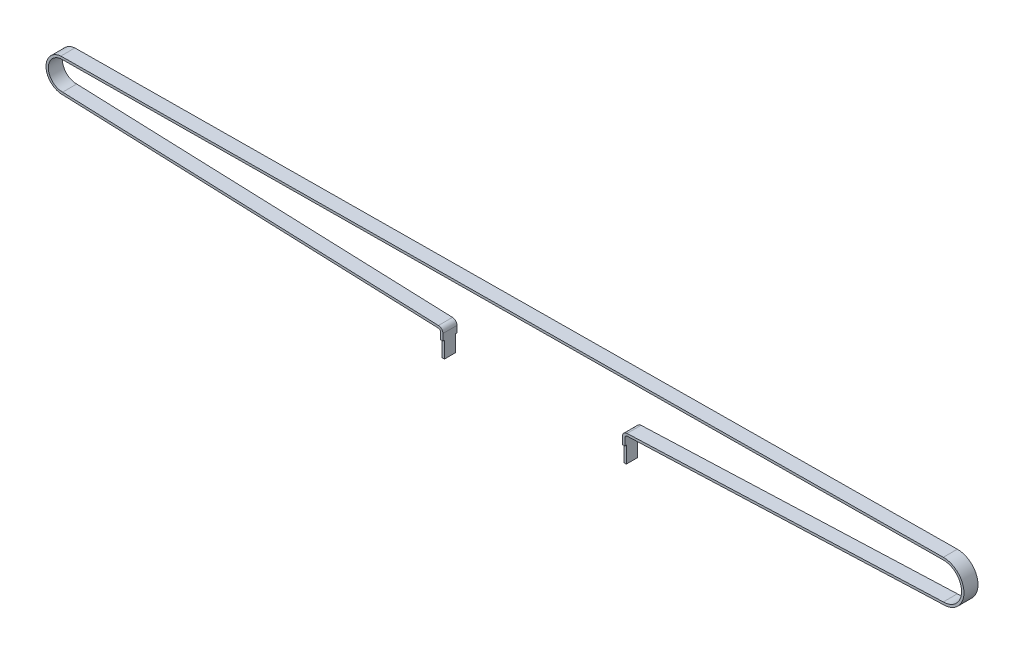
ISO-10303-21;
HEADER;
FILE_DESCRIPTION(('STEP AP214'),'2;1');
FILE_NAME('part.step','',(''),(''),'','','');
FILE_SCHEMA(('AUTOMOTIVE_DESIGN { 1 0 10303 214 1 1 1 1 }'));
ENDSEC;
DATA;
#1=APPLICATION_CONTEXT('core data for automotive mechanical design processes');
#2=APPLICATION_PROTOCOL_DEFINITION('international standard','automotive_design',2000,#1);
#3=PRODUCT_CONTEXT('',#1,'mechanical');
#4=PRODUCT('Part','Part','',(#3));
#5=PRODUCT_RELATED_PRODUCT_CATEGORY('part','',(#4));
#6=PRODUCT_DEFINITION_FORMATION('','',#4);
#7=PRODUCT_DEFINITION_CONTEXT('part definition',#1,'design');
#8=PRODUCT_DEFINITION('design','',#6,#7);
#9=PRODUCT_DEFINITION_SHAPE('','',#8);
#10=(LENGTH_UNIT() NAMED_UNIT(*) SI_UNIT(.MILLI.,.METRE.));
#11=(NAMED_UNIT(*) PLANE_ANGLE_UNIT() SI_UNIT($,.RADIAN.));
#12=(NAMED_UNIT(*) SI_UNIT($,.STERADIAN.) SOLID_ANGLE_UNIT());
#13=UNCERTAINTY_MEASURE_WITH_UNIT(LENGTH_MEASURE(1.E-05),#10,'distance_accuracy_value','');
#14=(GEOMETRIC_REPRESENTATION_CONTEXT(3) GLOBAL_UNCERTAINTY_ASSIGNED_CONTEXT((#13)) GLOBAL_UNIT_ASSIGNED_CONTEXT((#10,
#11,#12)) REPRESENTATION_CONTEXT('',''));
#15=CARTESIAN_POINT('',(0.,0.,0.));
#16=DIRECTION('',(0.,0.,1.));
#17=DIRECTION('',(1.,0.,0.));
#18=AXIS2_PLACEMENT_3D('',#15,#16,#17);
#19=CARTESIAN_POINT('',(-136.512046169934,-17.8499999999999,3.));
#20=DIRECTION('',(0.,-1.,0.));
#21=DIRECTION('',(0.,0.,-1.));
#22=AXIS2_PLACEMENT_3D('',#19,#20,#21);
#23=CYLINDRICAL_SURFACE('',#22,2.37102628897258);
#24=CARTESIAN_POINT('',(-136.512046169934,-24.8499999999999,3.));
#25=DIRECTION('',(0.,-1.,0.));
#26=DIRECTION('',(0.,0.,-1.));
#27=AXIS2_PLACEMENT_3D('',#24,#25,#26);
#28=CIRCLE('',#27,2.37102628897258);
#29=CARTESIAN_POINT('',(-136.965713461682,-24.8499999999999,0.672780274362313));
#30=VERTEX_POINT('',#29);
#31=CARTESIAN_POINT('',(-135.965713461682,-24.8499999999999,0.692775209284312));
#32=VERTEX_POINT('',#31);
#33=EDGE_CURVE('E19',#30,#32,#28,.T.);
#34=ORIENTED_EDGE('',*,*,#33,.F.);
#35=DIRECTION('',(0.,1.,0.));
#36=VECTOR('',#35,1.);
#37=CARTESIAN_POINT('',(-136.965713461682,-14.6989519799683,0.672780274362313));
#38=LINE('',#37,#36);
#39=CARTESIAN_POINT('',(-136.965713461682,-17.8499999999999,0.672780274362313));
#40=VERTEX_POINT('',#39);
#41=EDGE_CURVE('E181',#40,#30,#38,.F.);
#42=ORIENTED_EDGE('',*,*,#41,.F.);
#43=CARTESIAN_POINT('',(-136.512046169934,-17.8499999999999,3.));
#44=DIRECTION('',(0.,-1.,0.));
#45=DIRECTION('',(0.,0.,-1.));
#46=AXIS2_PLACEMENT_3D('',#43,#44,#45);
#47=CIRCLE('',#46,2.37102628897258);
#48=CARTESIAN_POINT('',(-135.965713461682,-17.8499999999999,0.692775209284312));
#49=VERTEX_POINT('',#48);
#50=EDGE_CURVE('E264',#49,#40,#47,.F.);
#51=ORIENTED_EDGE('',*,*,#50,.F.);
#52=DIRECTION('',(0.,1.,0.));
#53=VECTOR('',#52,1.);
#54=CARTESIAN_POINT('',(-135.965713461682,-14.6989519799683,0.692775209284312));
#55=LINE('',#54,#53);
#56=EDGE_CURVE('E183',#49,#32,#55,.F.);
#57=ORIENTED_EDGE('',*,*,#56,.T.);
#58=EDGE_LOOP('',(#34,#42,#51,#57));
#59=FACE_BOUND('',#58,.T.);
#60=ADVANCED_FACE('F16',(#59),#23,.T.);
#61=CARTESIAN_POINT('',(-135.965713461682,-24.8499999999998,6.));
#62=DIRECTION('',(0.,-1.,0.));
#63=DIRECTION('',(0.,0.,-1.));
#64=AXIS2_PLACEMENT_3D('',#61,#62,#63);
#65=PLANE('',#64);
#66=DIRECTION('',(0.,0.,1.));
#67=VECTOR('',#66,1.);
#68=CARTESIAN_POINT('',(-136.965713461682,-24.8499999999999,6.));
#69=LINE('',#68,#67);
#70=CARTESIAN_POINT('',(-136.965713461682,-24.8499999999999,5.32721972563769));
#71=VERTEX_POINT('',#70);
#72=EDGE_CURVE('E193',#30,#71,#69,.T.);
#73=ORIENTED_EDGE('',*,*,#72,.F.);
#74=ORIENTED_EDGE('',*,*,#33,.T.);
#75=DIRECTION('',(0.,0.,1.));
#76=VECTOR('',#75,1.);
#77=CARTESIAN_POINT('',(-135.965713461682,-24.8499999999999,6.));
#78=LINE('',#77,#76);
#79=CARTESIAN_POINT('',(-135.965713461682,-24.8499999999999,5.30722479071569));
#80=VERTEX_POINT('',#79);
#81=EDGE_CURVE('E208',#32,#80,#78,.T.);
#82=ORIENTED_EDGE('',*,*,#81,.T.);
#83=CARTESIAN_POINT('',(-136.512046169934,-24.8499999999999,3.));
#84=DIRECTION('',(0.,-1.,0.));
#85=DIRECTION('',(0.,0.,-1.));
#86=AXIS2_PLACEMENT_3D('',#83,#84,#85);
#87=CIRCLE('',#86,2.37102628897258);
#88=EDGE_CURVE('E188',#71,#80,#87,.F.);
#89=ORIENTED_EDGE('',*,*,#88,.F.);
#90=EDGE_LOOP('',(#73,#74,#82,#89));
#91=FACE_BOUND('',#90,.T.);
#92=ADVANCED_FACE('F199',(#91),#65,.T.);
#93=CARTESIAN_POINT('',(-136.512046169934,-17.8499999999999,3.));
#94=DIRECTION('',(0.,-1.,0.));
#95=DIRECTION('',(0.,0.,-1.));
#96=AXIS2_PLACEMENT_3D('',#93,#94,#95);
#97=CYLINDRICAL_SURFACE('',#96,2.37102628897258);
#98=CARTESIAN_POINT('',(-136.512046169934,-17.8499999999999,3.));
#99=DIRECTION('',(0.,-1.,0.));
#100=DIRECTION('',(0.,0.,-1.));
#101=AXIS2_PLACEMENT_3D('',#98,#99,#100);
#102=CIRCLE('',#101,2.37102628897258);
#103=CARTESIAN_POINT('',(-136.965713461682,-17.8499999999999,5.32721972563769));
#104=VERTEX_POINT('',#103);
#105=CARTESIAN_POINT('',(-135.965713461682,-17.8499999999999,5.30722479071569));
#106=VERTEX_POINT('',#105);
#107=EDGE_CURVE('E209',#104,#106,#102,.F.);
#108=ORIENTED_EDGE('',*,*,#107,.F.);
#109=DIRECTION('',(0.,1.,0.));
#110=VECTOR('',#109,1.);
#111=CARTESIAN_POINT('',(-136.965713461682,-14.6989519799683,5.32721972563769));
#112=LINE('',#111,#110);
#113=EDGE_CURVE('E201',#71,#104,#112,.T.);
#114=ORIENTED_EDGE('',*,*,#113,.F.);
#115=ORIENTED_EDGE('',*,*,#88,.T.);
#116=DIRECTION('',(0.,1.,0.));
#117=VECTOR('',#116,1.);
#118=CARTESIAN_POINT('',(-135.965713461682,-14.6989519799683,5.30722479071569));
#119=LINE('',#118,#117);
#120=EDGE_CURVE('E210',#80,#106,#119,.T.);
#121=ORIENTED_EDGE('',*,*,#120,.T.);
#122=EDGE_LOOP('',(#108,#114,#115,#121));
#123=FACE_BOUND('',#122,.T.);
#124=ADVANCED_FACE('F284',(#123),#97,.T.);
#125=CARTESIAN_POINT('',(-214.211733164608,-17.8499999999999,3.));
#126=DIRECTION('',(0.,-1.,0.));
#127=DIRECTION('',(0.,0.,-1.));
#128=AXIS2_PLACEMENT_3D('',#125,#126,#127);
#129=CYLINDRICAL_SURFACE('',#128,2.37102628897258);
#130=DIRECTION('',(0.,1.,0.));
#131=VECTOR('',#130,1.);
#132=CARTESIAN_POINT('',(-213.634920156836,-15.0663873438456,5.29979399448392));
#133=LINE('',#132,#131);
#134=CARTESIAN_POINT('',(-213.634920156836,-17.8499999999999,5.29979399448392));
#135=VERTEX_POINT('',#134);
#136=CARTESIAN_POINT('',(-213.634920156836,-24.8499999999999,5.29979399448392));
#137=VERTEX_POINT('',#136);
#138=EDGE_CURVE('E324',#135,#137,#133,.F.);
#139=ORIENTED_EDGE('',*,*,#138,.F.);
#140=CARTESIAN_POINT('',(-214.211733164608,-17.8499999999999,3.));
#141=DIRECTION('',(0.,-1.,0.));
#142=DIRECTION('',(0.,0.,-1.));
#143=AXIS2_PLACEMENT_3D('',#140,#141,#142);
#144=CIRCLE('',#143,2.37102628897258);
#145=CARTESIAN_POINT('',(-214.634920156836,-17.8499999999999,5.33295487153265));
#146=VERTEX_POINT('',#145);
#147=EDGE_CURVE('E268',#146,#135,#144,.F.);
#148=ORIENTED_EDGE('',*,*,#147,.F.);
#149=DIRECTION('',(0.,1.,0.));
#150=VECTOR('',#149,1.);
#151=CARTESIAN_POINT('',(-214.634920156836,-15.0663873438456,5.33295487153265));
#152=LINE('',#151,#150);
#153=CARTESIAN_POINT('',(-214.634920156836,-24.8499999999999,5.33295487153265));
#154=VERTEX_POINT('',#153);
#155=EDGE_CURVE('E262',#146,#154,#152,.F.);
#156=ORIENTED_EDGE('',*,*,#155,.T.);
#157=CARTESIAN_POINT('',(-214.211733164608,-24.8499999999999,3.));
#158=DIRECTION('',(0.,-1.,0.));
#159=DIRECTION('',(0.,0.,-1.));
#160=AXIS2_PLACEMENT_3D('',#157,#158,#159);
#161=CIRCLE('',#160,2.37102628897258);
#162=EDGE_CURVE('E280',#137,#154,#161,.T.);
#163=ORIENTED_EDGE('',*,*,#162,.F.);
#164=EDGE_LOOP('',(#139,#148,#156,#163));
#165=FACE_BOUND('',#164,.T.);
#166=ADVANCED_FACE('F359',(#165),#129,.T.);
#167=CARTESIAN_POINT('',(-213.634920156836,-24.8499999999999,6.));
#168=DIRECTION('',(0.,-1.,0.));
#169=DIRECTION('',(0.,0.,-1.));
#170=AXIS2_PLACEMENT_3D('',#167,#168,#169);
#171=PLANE('',#170);
#172=CARTESIAN_POINT('',(-214.211733164608,-24.8499999999999,3.));
#173=DIRECTION('',(0.,-1.,0.));
#174=DIRECTION('',(0.,0.,-1.));
#175=AXIS2_PLACEMENT_3D('',#172,#173,#174);
#176=CIRCLE('',#175,2.37102628897258);
#177=CARTESIAN_POINT('',(-213.634920156836,-24.8499999999999,0.700206005516082));
#178=VERTEX_POINT('',#177);
#179=CARTESIAN_POINT('',(-214.634920156836,-24.8499999999999,0.667045128467347));
#180=VERTEX_POINT('',#179);
#181=EDGE_CURVE('E278',#178,#180,#176,.F.);
#182=ORIENTED_EDGE('',*,*,#181,.F.);
#183=DIRECTION('',(0.,0.,-1.));
#184=VECTOR('',#183,1.);
#185=CARTESIAN_POINT('',(-213.634920156836,-24.8499999999999,6.));
#186=LINE('',#185,#184);
#187=EDGE_CURVE('E346',#137,#178,#186,.T.);
#188=ORIENTED_EDGE('',*,*,#187,.F.);
#189=ORIENTED_EDGE('',*,*,#162,.T.);
#190=DIRECTION('',(0.,0.,-1.));
#191=VECTOR('',#190,1.);
#192=CARTESIAN_POINT('',(-214.634920156836,-24.8499999999999,6.));
#193=LINE('',#192,#191);
#194=EDGE_CURVE('E335',#154,#180,#193,.T.);
#195=ORIENTED_EDGE('',*,*,#194,.T.);
#196=EDGE_LOOP('',(#182,#188,#189,#195));
#197=FACE_BOUND('',#196,.T.);
#198=ADVANCED_FACE('F362',(#197),#171,.T.);
#199=CARTESIAN_POINT('',(-214.211733164608,-17.8499999999999,3.));
#200=DIRECTION('',(0.,-1.,0.));
#201=DIRECTION('',(0.,0.,-1.));
#202=AXIS2_PLACEMENT_3D('',#199,#200,#201);
#203=CYLINDRICAL_SURFACE('',#202,2.37102628897258);
#204=ORIENTED_EDGE('',*,*,#181,.T.);
#205=DIRECTION('',(0.,1.,0.));
#206=VECTOR('',#205,1.);
#207=CARTESIAN_POINT('',(-214.634920156836,-15.0663873438456,0.667045128467348));
#208=LINE('',#207,#206);
#209=CARTESIAN_POINT('',(-214.634920156836,-17.8499999999999,0.667045128467347));
#210=VERTEX_POINT('',#209);
#211=EDGE_CURVE('E336',#180,#210,#208,.T.);
#212=ORIENTED_EDGE('',*,*,#211,.T.);
#213=CARTESIAN_POINT('',(-214.211733164608,-17.8499999999999,3.));
#214=DIRECTION('',(0.,-1.,0.));
#215=DIRECTION('',(0.,0.,-1.));
#216=AXIS2_PLACEMENT_3D('',#213,#214,#215);
#217=CIRCLE('',#216,2.37102628897258);
#218=CARTESIAN_POINT('',(-213.634920156836,-17.8499999999999,0.700206005516082));
#219=VERTEX_POINT('',#218);
#220=EDGE_CURVE('E260',#219,#210,#217,.F.);
#221=ORIENTED_EDGE('',*,*,#220,.F.);
#222=DIRECTION('',(0.,1.,0.));
#223=VECTOR('',#222,1.);
#224=CARTESIAN_POINT('',(-213.634920156836,-15.0663873438456,0.700206005516082));
#225=LINE('',#224,#223);
#226=EDGE_CURVE('E342',#178,#219,#225,.T.);
#227=ORIENTED_EDGE('',*,*,#226,.F.);
#228=EDGE_LOOP('',(#204,#212,#221,#227));
#229=FACE_BOUND('',#228,.T.);
#230=ADVANCED_FACE('F365',(#229),#203,.T.);
#231=CARTESIAN_POINT('',(-215.634920156836,-15.0663873438456,6.));
#232=DIRECTION('',(0.,0.,-1.));
#233=DIRECTION('',(-1.,0.,0.));
#234=AXIS2_PLACEMENT_3D('',#231,#232,#233);
#235=CYLINDRICAL_SURFACE('',#234,1.);
#236=DIRECTION('',(0.,0.,-1.));
#237=VECTOR('',#236,1.);
#238=CARTESIAN_POINT('',(-214.634920156836,-15.0663873438456,6.));
#239=LINE('',#238,#237);
#240=CARTESIAN_POINT('',(-214.634920156836,-15.0663873438456,0.));
#241=VERTEX_POINT('',#240);
#242=CARTESIAN_POINT('',(-214.634920156836,-15.0663873438456,6.));
#243=VERTEX_POINT('',#242);
#244=EDGE_CURVE('E312',#241,#243,#239,.F.);
#245=ORIENTED_EDGE('',*,*,#244,.T.);
#246=CARTESIAN_POINT('',(-215.634920156836,-15.0663873438456,6.));
#247=DIRECTION('',(0.,0.,-1.));
#248=DIRECTION('',(-1.,0.,0.));
#249=AXIS2_PLACEMENT_3D('',#246,#247,#248);
#250=CIRCLE('',#249,1.);
#251=CARTESIAN_POINT('',(-215.597127485655,-14.0671017420254,6.));
#252=VERTEX_POINT('',#251);
#253=EDGE_CURVE('E276',#252,#243,#250,.T.);
#254=ORIENTED_EDGE('',*,*,#253,.F.);
#255=DIRECTION('',(0.,0.,1.));
#256=VECTOR('',#255,1.);
#257=CARTESIAN_POINT('',(-215.597127485655,-14.0671017420254,6.));
#258=LINE('',#257,#256);
#259=CARTESIAN_POINT('',(-215.597127485655,-14.0671017420254,0.));
#260=VERTEX_POINT('',#259);
#261=EDGE_CURVE('E311',#252,#260,#258,.F.);
#262=ORIENTED_EDGE('',*,*,#261,.T.);
#263=CARTESIAN_POINT('',(-215.634920156836,-15.0663873438456,0.));
#264=DIRECTION('',(0.,0.,-1.));
#265=DIRECTION('',(-1.,0.,0.));
#266=AXIS2_PLACEMENT_3D('',#263,#264,#265);
#267=CIRCLE('',#266,1.);
#268=EDGE_CURVE('E274',#241,#260,#267,.F.);
#269=ORIENTED_EDGE('',*,*,#268,.F.);
#270=EDGE_LOOP('',(#245,#254,#262,#269));
#271=FACE_BOUND('',#270,.T.);
#272=ADVANCED_FACE('F523',(#271),#235,.F.);
#273=CARTESIAN_POINT('',(-134.965713461682,-14.6989519799683,6.));
#274=DIRECTION('',(0.,0.,-1.));
#275=DIRECTION('',(-1.,0.,0.));
#276=AXIS2_PLACEMENT_3D('',#273,#274,#275);
#277=CYLINDRICAL_SURFACE('',#276,1.);
#278=DIRECTION('',(0.,0.,1.));
#279=VECTOR('',#278,1.);
#280=CARTESIAN_POINT('',(-135.004194493676,-13.6996926491754,6.));
#281=LINE('',#280,#279);
#282=CARTESIAN_POINT('',(-135.004194493676,-13.6996926491754,0.));
#283=VERTEX_POINT('',#282);
#284=CARTESIAN_POINT('',(-135.004194493676,-13.6996926491754,6.));
#285=VERTEX_POINT('',#284);
#286=EDGE_CURVE('E781',#283,#285,#281,.T.);
#287=ORIENTED_EDGE('',*,*,#286,.T.);
#288=CARTESIAN_POINT('',(-134.965713461682,-14.6989519799683,6.));
#289=DIRECTION('',(0.,0.,-1.));
#290=DIRECTION('',(-1.,0.,0.));
#291=AXIS2_PLACEMENT_3D('',#288,#289,#290);
#292=CIRCLE('',#291,1.);
#293=CARTESIAN_POINT('',(-135.965713461682,-14.6989519799683,6.));
#294=VERTEX_POINT('',#293);
#295=EDGE_CURVE('E272',#294,#285,#292,.T.);
#296=ORIENTED_EDGE('',*,*,#295,.F.);
#297=DIRECTION('',(0.,0.,1.));
#298=VECTOR('',#297,1.);
#299=CARTESIAN_POINT('',(-135.965713461682,-14.6989519799683,6.));
#300=LINE('',#299,#298);
#301=CARTESIAN_POINT('',(-135.965713461682,-14.6989519799683,0.));
#302=VERTEX_POINT('',#301);
#303=EDGE_CURVE('E297',#294,#302,#300,.F.);
#304=ORIENTED_EDGE('',*,*,#303,.T.);
#305=CARTESIAN_POINT('',(-134.965713461682,-14.6989519799683,0.));
#306=DIRECTION('',(0.,0.,-1.));
#307=DIRECTION('',(-1.,0.,0.));
#308=AXIS2_PLACEMENT_3D('',#305,#306,#307);
#309=CIRCLE('',#308,1.);
#310=EDGE_CURVE('E270',#283,#302,#309,.F.);
#311=ORIENTED_EDGE('',*,*,#310,.F.);
#312=EDGE_LOOP('',(#287,#296,#304,#311));
#313=FACE_BOUND('',#312,.T.);
#314=ADVANCED_FACE('F519',(#313),#277,.F.);
#315=CARTESIAN_POINT('',(-214.211733164608,-17.8499999999999,3.));
#316=DIRECTION('',(0.,-1.,0.));
#317=DIRECTION('',(0.,0.,-1.));
#318=AXIS2_PLACEMENT_3D('',#315,#316,#317);
#319=PLANE('',#318);
#320=DIRECTION('',(0.,0.,-1.));
#321=VECTOR('',#320,1.);
#322=CARTESIAN_POINT('',(-213.634920156836,-17.8499999999999,6.));
#323=LINE('',#322,#321);
#324=CARTESIAN_POINT('',(-213.634920156836,-17.8499999999999,6.));
#325=VERTEX_POINT('',#324);
#326=EDGE_CURVE('E321',#325,#135,#323,.T.);
#327=ORIENTED_EDGE('',*,*,#326,.F.);
#328=DIRECTION('',(-1.,0.,0.));
#329=VECTOR('',#328,1.);
#330=CARTESIAN_POINT('',(-215.634920156836,-17.8499999999999,6.));
#331=LINE('',#330,#329);
#332=CARTESIAN_POINT('',(-214.634920156836,-17.8499999999999,6.));
#333=VERTEX_POINT('',#332);
#334=EDGE_CURVE('E315',#325,#333,#331,.T.);
#335=ORIENTED_EDGE('',*,*,#334,.T.);
#336=DIRECTION('',(0.,0.,-1.));
#337=VECTOR('',#336,1.);
#338=CARTESIAN_POINT('',(-214.634920156836,-17.8499999999999,6.));
#339=LINE('',#338,#337);
#340=EDGE_CURVE('E308',#333,#146,#339,.T.);
#341=ORIENTED_EDGE('',*,*,#340,.T.);
#342=ORIENTED_EDGE('',*,*,#147,.T.);
#343=EDGE_LOOP('',(#327,#335,#341,#342));
#344=FACE_BOUND('',#343,.T.);
#345=ADVANCED_FACE('F516',(#344),#319,.T.);
#346=CARTESIAN_POINT('',(-136.512046169934,-17.8499999999999,3.));
#347=DIRECTION('',(0.,-1.,0.));
#348=DIRECTION('',(0.,0.,-1.));
#349=AXIS2_PLACEMENT_3D('',#346,#347,#348);
#350=PLANE('',#349);
#351=DIRECTION('',(-1.,0.,0.));
#352=VECTOR('',#351,1.);
#353=CARTESIAN_POINT('',(-215.634920156836,-17.8499999999999,6.));
#354=LINE('',#353,#352);
#355=CARTESIAN_POINT('',(-135.965713461682,-17.8499999999999,6.));
#356=VERTEX_POINT('',#355);
#357=CARTESIAN_POINT('',(-136.965713461682,-17.8499999999999,6.));
#358=VERTEX_POINT('',#357);
#359=EDGE_CURVE('E237',#356,#358,#354,.T.);
#360=ORIENTED_EDGE('',*,*,#359,.T.);
#361=DIRECTION('',(0.,0.,1.));
#362=VECTOR('',#361,1.);
#363=CARTESIAN_POINT('',(-136.965713461682,-17.8499999999999,6.));
#364=LINE('',#363,#362);
#365=EDGE_CURVE('E203',#104,#358,#364,.T.);
#366=ORIENTED_EDGE('',*,*,#365,.F.);
#367=ORIENTED_EDGE('',*,*,#107,.T.);
#368=DIRECTION('',(0.,0.,1.));
#369=VECTOR('',#368,1.);
#370=CARTESIAN_POINT('',(-135.965713461682,-17.8499999999999,6.));
#371=LINE('',#370,#369);
#372=EDGE_CURVE('E213',#106,#356,#371,.T.);
#373=ORIENTED_EDGE('',*,*,#372,.T.);
#374=EDGE_LOOP('',(#360,#366,#367,#373));
#375=FACE_BOUND('',#374,.T.);
#376=ADVANCED_FACE('F513',(#375),#350,.T.);
#377=CARTESIAN_POINT('',(-135.965713461682,-14.6989519799683,6.));
#378=DIRECTION('',(-1.,0.,0.));
#379=DIRECTION('',(0.,0.,1.));
#380=AXIS2_PLACEMENT_3D('',#377,#378,#379);
#381=PLANE('',#380);
#382=DIRECTION('',(0.,1.,0.));
#383=VECTOR('',#382,1.);
#384=CARTESIAN_POINT('',(-135.965713461682,-15.0663873438456,0.));
#385=LINE('',#384,#383);
#386=CARTESIAN_POINT('',(-135.965713461682,-17.8499999999999,0.));
#387=VERTEX_POINT('',#386);
#388=EDGE_CURVE('E236',#302,#387,#385,.F.);
#389=ORIENTED_EDGE('',*,*,#388,.F.);
#390=ORIENTED_EDGE('',*,*,#303,.F.);
#391=DIRECTION('',(0.,1.,0.));
#392=VECTOR('',#391,1.);
#393=CARTESIAN_POINT('',(-135.965713461682,-15.0663873438456,6.));
#394=LINE('',#393,#392);
#395=EDGE_CURVE('E293',#294,#356,#394,.F.);
#396=ORIENTED_EDGE('',*,*,#395,.T.);
#397=ORIENTED_EDGE('',*,*,#372,.F.);
#398=ORIENTED_EDGE('',*,*,#120,.F.);
#399=ORIENTED_EDGE('',*,*,#81,.F.);
#400=ORIENTED_EDGE('',*,*,#56,.F.);
#401=DIRECTION('',(0.,0.,-1.));
#402=VECTOR('',#401,1.);
#403=CARTESIAN_POINT('',(-135.965713461682,-17.8499999999999,3.));
#404=LINE('',#403,#402);
#405=EDGE_CURVE('E266',#387,#49,#404,.F.);
#406=ORIENTED_EDGE('',*,*,#405,.F.);
#407=EDGE_LOOP('',(#389,#390,#396,#397,#398,#399,#400,#406));
#408=FACE_BOUND('',#407,.T.);
#409=ADVANCED_FACE('F288',(#408),#381,.F.);
#410=CARTESIAN_POINT('',(-136.512046169934,-17.8499999999999,3.));
#411=DIRECTION('',(0.,-1.,0.));
#412=DIRECTION('',(0.,0.,-1.));
#413=AXIS2_PLACEMENT_3D('',#410,#411,#412);
#414=PLANE('',#413);
#415=ORIENTED_EDGE('',*,*,#50,.T.);
#416=DIRECTION('',(0.,0.,1.));
#417=VECTOR('',#416,1.);
#418=CARTESIAN_POINT('',(-136.965713461682,-17.8499999999999,6.));
#419=LINE('',#418,#417);
#420=CARTESIAN_POINT('',(-136.965713461682,-17.8499999999999,0.));
#421=VERTEX_POINT('',#420);
#422=EDGE_CURVE('E197',#421,#40,#419,.T.);
#423=ORIENTED_EDGE('',*,*,#422,.F.);
#424=DIRECTION('',(-1.,0.,0.));
#425=VECTOR('',#424,1.);
#426=CARTESIAN_POINT('',(-215.634920156836,-17.8499999999999,0.));
#427=LINE('',#426,#425);
#428=EDGE_CURVE('E411',#387,#421,#427,.T.);
#429=ORIENTED_EDGE('',*,*,#428,.F.);
#430=ORIENTED_EDGE('',*,*,#405,.T.);
#431=EDGE_LOOP('',(#415,#423,#429,#430));
#432=FACE_BOUND('',#431,.T.);
#433=ADVANCED_FACE('F421',(#432),#414,.T.);
#434=CARTESIAN_POINT('',(-136.965713461682,-14.6989519799683,6.));
#435=DIRECTION('',(-1.,0.,0.));
#436=DIRECTION('',(0.,0.,1.));
#437=AXIS2_PLACEMENT_3D('',#434,#435,#436);
#438=PLANE('',#437);
#439=DIRECTION('',(0.,1.,0.));
#440=VECTOR('',#439,1.);
#441=CARTESIAN_POINT('',(-136.965713461682,-15.0663873438456,6.));
#442=LINE('',#441,#440);
#443=CARTESIAN_POINT('',(-136.965713461682,-14.6989519799683,6.));
#444=VERTEX_POINT('',#443);
#445=EDGE_CURVE('E259',#358,#444,#442,.T.);
#446=ORIENTED_EDGE('',*,*,#445,.T.);
#447=DIRECTION('',(0.,0.,-1.));
#448=VECTOR('',#447,1.);
#449=CARTESIAN_POINT('',(-136.965713461682,-14.6989519799683,6.));
#450=LINE('',#449,#448);
#451=CARTESIAN_POINT('',(-136.965713461682,-14.6989519799683,0.));
#452=VERTEX_POINT('',#451);
#453=EDGE_CURVE('E330',#452,#444,#450,.F.);
#454=ORIENTED_EDGE('',*,*,#453,.F.);
#455=DIRECTION('',(0.,1.,0.));
#456=VECTOR('',#455,1.);
#457=CARTESIAN_POINT('',(-136.965713461682,-15.0663873438456,0.));
#458=LINE('',#457,#456);
#459=EDGE_CURVE('E233',#421,#452,#458,.T.);
#460=ORIENTED_EDGE('',*,*,#459,.F.);
#461=ORIENTED_EDGE('',*,*,#422,.T.);
#462=ORIENTED_EDGE('',*,*,#41,.T.);
#463=ORIENTED_EDGE('',*,*,#72,.T.);
#464=ORIENTED_EDGE('',*,*,#113,.T.);
#465=ORIENTED_EDGE('',*,*,#365,.T.);
#466=EDGE_LOOP('',(#446,#454,#460,#461,#462,#463,#464,#465));
#467=FACE_BOUND('',#466,.T.);
#468=ADVANCED_FACE('F192',(#467),#438,.T.);
#469=CARTESIAN_POINT('',(-134.965713461682,-14.6989519799683,6.));
#470=DIRECTION('',(0.,0.,-1.));
#471=DIRECTION('',(-1.,0.,0.));
#472=AXIS2_PLACEMENT_3D('',#469,#470,#471);
#473=CYLINDRICAL_SURFACE('',#472,2.);
#474=CARTESIAN_POINT('',(-134.965713461682,-14.6989519799683,6.));
#475=DIRECTION('',(0.,0.,-1.));
#476=DIRECTION('',(-1.,0.,0.));
#477=AXIS2_PLACEMENT_3D('',#474,#475,#476);
#478=CIRCLE('',#477,2.);
#479=CARTESIAN_POINT('',(-135.042675525671,-12.7004333183825,6.));
#480=VERTEX_POINT('',#479);
#481=EDGE_CURVE('E256',#444,#480,#478,.T.);
#482=ORIENTED_EDGE('',*,*,#481,.T.);
#483=DIRECTION('',(0.,0.,1.));
#484=VECTOR('',#483,1.);
#485=CARTESIAN_POINT('',(-135.042675525671,-12.7004333183825,6.));
#486=LINE('',#485,#484);
#487=CARTESIAN_POINT('',(-135.042675525671,-12.7004333183825,0.));
#488=VERTEX_POINT('',#487);
#489=EDGE_CURVE('E405',#488,#480,#486,.T.);
#490=ORIENTED_EDGE('',*,*,#489,.F.);
#491=CARTESIAN_POINT('',(-134.965713461682,-14.6989519799683,0.));
#492=DIRECTION('',(0.,0.,-1.));
#493=DIRECTION('',(-1.,0.,0.));
#494=AXIS2_PLACEMENT_3D('',#491,#492,#493);
#495=CIRCLE('',#494,2.);
#496=EDGE_CURVE('E231',#452,#488,#495,.T.);
#497=ORIENTED_EDGE('',*,*,#496,.F.);
#498=ORIENTED_EDGE('',*,*,#453,.T.);
#499=EDGE_LOOP('',(#482,#490,#497,#498));
#500=FACE_BOUND('',#499,.T.);
#501=ADVANCED_FACE('F502',(#500),#473,.T.);
#502=CARTESIAN_POINT('',(2.10959385471912E-12,-7.49999999999987,6.));
#503=DIRECTION('',(-0.0384810319947494,0.999259330792872,0.));
#504=DIRECTION('',(-0.999259330792872,-0.0384810319947494,0.));
#505=AXIS2_PLACEMENT_3D('',#502,#503,#504);
#506=PLANE('',#505);
#507=DIRECTION('',(0.999259330792872,0.0384810319947494,0.));
#508=VECTOR('',#507,1.);
#509=CARTESIAN_POINT('',(-135.042675525671,-12.7004333183825,6.));
#510=LINE('',#509,#508);
#511=CARTESIAN_POINT('',(2.10358260758353E-12,-7.49999999999987,6.));
#512=VERTEX_POINT('',#511);
#513=EDGE_CURVE('E255',#480,#512,#510,.T.);
#514=ORIENTED_EDGE('',*,*,#513,.T.);
#515=DIRECTION('',(0.,0.,-1.));
#516=VECTOR('',#515,1.);
#517=CARTESIAN_POINT('',(2.11088741972065E-12,-7.49999999999987,6.));
#518=LINE('',#517,#516);
#519=CARTESIAN_POINT('',(2.10516825326079E-12,-7.49999999999987,0.));
#520=VERTEX_POINT('',#519);
#521=EDGE_CURVE('E402',#512,#520,#518,.T.);
#522=ORIENTED_EDGE('',*,*,#521,.T.);
#523=DIRECTION('',(0.999259330792872,0.0384810319947494,0.));
#524=VECTOR('',#523,1.);
#525=CARTESIAN_POINT('',(-135.042675525671,-12.7004333183825,0.));
#526=LINE('',#525,#524);
#527=EDGE_CURVE('E230',#488,#520,#526,.T.);
#528=ORIENTED_EDGE('',*,*,#527,.F.);
#529=ORIENTED_EDGE('',*,*,#489,.T.);
#530=EDGE_LOOP('',(#514,#522,#528,#529));
#531=FACE_BOUND('',#530,.T.);
#532=ADVANCED_FACE('F498',(#531),#506,.T.);
#533=CARTESIAN_POINT('',(0.0626088957112461,0.250000000000125,6.));
#534=DIRECTION('',(0.,0.,-1.));
#535=DIRECTION('',(-1.,0.,0.));
#536=AXIS2_PLACEMENT_3D('',#533,#534,#535);
#537=CYLINDRICAL_SURFACE('',#536,7.75025289095923);
#538=ORIENTED_EDGE('',*,*,#521,.F.);
#539=CARTESIAN_POINT('',(0.0626088957112461,0.250000000000125,6.));
#540=DIRECTION('',(0.,0.,-1.));
#541=DIRECTION('',(-1.,0.,0.));
#542=AXIS2_PLACEMENT_3D('',#539,#540,#541);
#543=CIRCLE('',#542,7.75025289095923);
#544=CARTESIAN_POINT('',(2.12215541204406E-12,8.00000000000012,6.));
#545=VERTEX_POINT('',#544);
#546=EDGE_CURVE('E252',#512,#545,#543,.F.);
#547=ORIENTED_EDGE('',*,*,#546,.T.);
#548=DIRECTION('',(0.,0.,1.));
#549=VECTOR('',#548,1.);
#550=CARTESIAN_POINT('',(2.10938121980497E-12,8.00000000000012,6.));
#551=LINE('',#550,#549);
#552=CARTESIAN_POINT('',(2.12215541204406E-12,8.00000000000012,0.));
#553=VERTEX_POINT('',#552);
#554=EDGE_CURVE('E400',#553,#545,#551,.T.);
#555=ORIENTED_EDGE('',*,*,#554,.F.);
#556=CARTESIAN_POINT('',(0.0626088957112461,0.250000000000125,0.));
#557=DIRECTION('',(0.,0.,-1.));
#558=DIRECTION('',(-1.,0.,0.));
#559=AXIS2_PLACEMENT_3D('',#556,#557,#558);
#560=CIRCLE('',#559,7.75025289095923);
#561=EDGE_CURVE('E228',#520,#553,#560,.F.);
#562=ORIENTED_EDGE('',*,*,#561,.F.);
#563=EDGE_LOOP('',(#538,#547,#555,#562));
#564=FACE_BOUND('',#563,.T.);
#565=ADVANCED_FACE('F494',(#564),#537,.F.);
#566=CARTESIAN_POINT('',(2.10938121980497E-12,8.00000000000012,6.));
#567=DIRECTION('',(0.00807830358441217,-0.99996736997324,0.));
#568=DIRECTION('',(0.99996736997324,0.00807830358441217,0.));
#569=AXIS2_PLACEMENT_3D('',#566,#567,#568);
#570=PLANE('',#569);
#571=DIRECTION('',(-0.99996736997324,-0.00807830358440887,0.));
#572=VECTOR('',#571,1.);
#573=CARTESIAN_POINT('',(2.1094237467878E-12,8.00000000000012,6.));
#574=LINE('',#573,#572);
#575=CARTESIAN_POINT('',(-376.720010472211,4.95664208423368,6.));
#576=VERTEX_POINT('',#575);
#577=EDGE_CURVE('E251',#545,#576,#574,.T.);
#578=ORIENTED_EDGE('',*,*,#577,.T.);
#579=DIRECTION('',(0.,0.,-1.));
#580=VECTOR('',#579,1.);
#581=CARTESIAN_POINT('',(-376.720010472211,4.95664208423369,6.));
#582=LINE('',#581,#580);
#583=CARTESIAN_POINT('',(-376.720010472211,4.95664208423368,0.));
#584=VERTEX_POINT('',#583);
#585=EDGE_CURVE('E397',#576,#584,#582,.T.);
#586=ORIENTED_EDGE('',*,*,#585,.T.);
#587=DIRECTION('',(-0.99996736997324,-0.00807830358440887,0.));
#588=VECTOR('',#587,1.);
#589=CARTESIAN_POINT('',(2.1094237467878E-12,8.00000000000012,0.));
#590=LINE('',#589,#588);
#591=EDGE_CURVE('E227',#553,#584,#590,.T.);
#592=ORIENTED_EDGE('',*,*,#591,.F.);
#593=ORIENTED_EDGE('',*,*,#554,.T.);
#594=EDGE_LOOP('',(#578,#586,#592,#593));
#595=FACE_BOUND('',#594,.T.);
#596=ADVANCED_FACE('F490',(#595),#570,.T.);
#597=CARTESIAN_POINT('',(-376.114107736079,-1.00687139119591,6.));
#598=DIRECTION('',(0.,0.,-1.));
#599=DIRECTION('',(-1.,0.,0.));
#600=AXIS2_PLACEMENT_3D('',#597,#598,#599);
#601=CYLINDRICAL_SURFACE('',#600,5.99421480239753);
#602=CARTESIAN_POINT('',(-376.114107736079,-1.00687139119591,6.));
#603=DIRECTION('',(0.,0.,-1.));
#604=DIRECTION('',(-1.,0.,0.));
#605=AXIS2_PLACEMENT_3D('',#602,#603,#604);
#606=CIRCLE('',#605,5.99421480239753);
#607=CARTESIAN_POINT('',(-376.000000000046,-7.00000000001672,6.));
#608=VERTEX_POINT('',#607);
#609=EDGE_CURVE('E248',#576,#608,#606,.F.);
#610=ORIENTED_EDGE('',*,*,#609,.T.);
#611=DIRECTION('',(0.,0.,1.));
#612=VECTOR('',#611,1.);
#613=CARTESIAN_POINT('',(-376.000000000035,-7.00000000001712,6.));
#614=LINE('',#613,#612);
#615=CARTESIAN_POINT('',(-376.000000000046,-7.00000000001672,0.));
#616=VERTEX_POINT('',#615);
#617=EDGE_CURVE('E395',#616,#608,#614,.T.);
#618=ORIENTED_EDGE('',*,*,#617,.F.);
#619=CARTESIAN_POINT('',(-376.114107736079,-1.00687139119591,0.));
#620=DIRECTION('',(0.,0.,-1.));
#621=DIRECTION('',(-1.,0.,0.));
#622=AXIS2_PLACEMENT_3D('',#619,#620,#621);
#623=CIRCLE('',#622,5.99421480239753);
#624=EDGE_CURVE('E225',#584,#616,#623,.F.);
#625=ORIENTED_EDGE('',*,*,#624,.F.);
#626=ORIENTED_EDGE('',*,*,#585,.F.);
#627=EDGE_LOOP('',(#610,#618,#625,#626));
#628=FACE_BOUND('',#627,.T.);
#629=ADVANCED_FACE('F486',(#628),#601,.F.);
#630=CARTESIAN_POINT('',(-376.000000000035,-7.00000000001712,6.));
#631=DIRECTION('',(0.0377926711807695,0.999285601820131,0.));
#632=DIRECTION('',(-0.999285601820131,0.0377926711807695,0.));
#633=AXIS2_PLACEMENT_3D('',#630,#631,#632);
#634=PLANE('',#633);
#635=DIRECTION('',(0.999285601820131,-0.0377926711807695,0.));
#636=VECTOR('',#635,1.);
#637=CARTESIAN_POINT('',(-376.000000000035,-7.00000000001712,6.));
#638=LINE('',#637,#636);
#639=CARTESIAN_POINT('',(-215.559334814474,-13.0678161402053,6.));
#640=VERTEX_POINT('',#639);
#641=EDGE_CURVE('E247',#608,#640,#638,.T.);
#642=ORIENTED_EDGE('',*,*,#641,.T.);
#643=DIRECTION('',(0.,0.,-1.));
#644=VECTOR('',#643,1.);
#645=CARTESIAN_POINT('',(-215.559334814474,-13.0678161402053,6.));
#646=LINE('',#645,#644);
#647=CARTESIAN_POINT('',(-215.559334814474,-13.0678161402053,0.));
#648=VERTEX_POINT('',#647);
#649=EDGE_CURVE('E325',#648,#640,#646,.F.);
#650=ORIENTED_EDGE('',*,*,#649,.F.);
#651=DIRECTION('',(0.999285601820131,-0.0377926711807695,0.));
#652=VECTOR('',#651,1.);
#653=CARTESIAN_POINT('',(-376.000000000035,-7.00000000001712,0.));
#654=LINE('',#653,#652);
#655=EDGE_CURVE('E224',#616,#648,#654,.T.);
#656=ORIENTED_EDGE('',*,*,#655,.F.);
#657=ORIENTED_EDGE('',*,*,#617,.T.);
#658=EDGE_LOOP('',(#642,#650,#656,#657));
#659=FACE_BOUND('',#658,.T.);
#660=ADVANCED_FACE('F482',(#659),#634,.T.);
#661=CARTESIAN_POINT('',(-215.634920156836,-15.0663873438456,6.));
#662=DIRECTION('',(0.,0.,-1.));
#663=DIRECTION('',(-1.,0.,0.));
#664=AXIS2_PLACEMENT_3D('',#661,#662,#663);
#665=CYLINDRICAL_SURFACE('',#664,2.);
#666=CARTESIAN_POINT('',(-215.634920156836,-15.0663873438456,6.));
#667=DIRECTION('',(0.,0.,-1.));
#668=DIRECTION('',(-1.,0.,0.));
#669=AXIS2_PLACEMENT_3D('',#666,#667,#668);
#670=CIRCLE('',#669,2.);
#671=CARTESIAN_POINT('',(-213.634920156836,-15.0663873438456,6.));
#672=VERTEX_POINT('',#671);
#673=EDGE_CURVE('E243',#640,#672,#670,.T.);
#674=ORIENTED_EDGE('',*,*,#673,.T.);
#675=DIRECTION('',(0.,0.,-1.));
#676=VECTOR('',#675,1.);
#677=CARTESIAN_POINT('',(-213.634920156836,-15.0663873438456,6.));
#678=LINE('',#677,#676);
#679=CARTESIAN_POINT('',(-213.634920156836,-15.0663873438456,0.));
#680=VERTEX_POINT('',#679);
#681=EDGE_CURVE('E345',#680,#672,#678,.F.);
#682=ORIENTED_EDGE('',*,*,#681,.F.);
#683=CARTESIAN_POINT('',(-215.634920156836,-15.0663873438456,0.));
#684=DIRECTION('',(0.,0.,-1.));
#685=DIRECTION('',(-1.,0.,0.));
#686=AXIS2_PLACEMENT_3D('',#683,#684,#685);
#687=CIRCLE('',#686,2.);
#688=EDGE_CURVE('E221',#648,#680,#687,.T.);
#689=ORIENTED_EDGE('',*,*,#688,.F.);
#690=ORIENTED_EDGE('',*,*,#649,.T.);
#691=EDGE_LOOP('',(#674,#682,#689,#690));
#692=FACE_BOUND('',#691,.T.);
#693=ADVANCED_FACE('F479',(#692),#665,.T.);
#694=CARTESIAN_POINT('',(-213.634920156836,-15.0663873438456,6.));
#695=DIRECTION('',(1.,0.,0.));
#696=DIRECTION('',(0.,0.,-1.));
#697=AXIS2_PLACEMENT_3D('',#694,#695,#696);
#698=PLANE('',#697);
#699=DIRECTION('',(0.,1.,0.));
#700=VECTOR('',#699,1.);
#701=CARTESIAN_POINT('',(-213.634920156836,-15.0663873438456,0.));
#702=LINE('',#701,#700);
#703=CARTESIAN_POINT('',(-213.634920156836,-17.8499999999999,0.));
#704=VERTEX_POINT('',#703);
#705=EDGE_CURVE('E223',#680,#704,#702,.F.);
#706=ORIENTED_EDGE('',*,*,#705,.F.);
#707=ORIENTED_EDGE('',*,*,#681,.T.);
#708=DIRECTION('',(0.,1.,0.));
#709=VECTOR('',#708,1.);
#710=CARTESIAN_POINT('',(-213.634920156836,-15.0663873438456,6.));
#711=LINE('',#710,#709);
#712=EDGE_CURVE('E246',#672,#325,#711,.F.);
#713=ORIENTED_EDGE('',*,*,#712,.T.);
#714=ORIENTED_EDGE('',*,*,#326,.T.);
#715=ORIENTED_EDGE('',*,*,#138,.T.);
#716=ORIENTED_EDGE('',*,*,#187,.T.);
#717=ORIENTED_EDGE('',*,*,#226,.T.);
#718=DIRECTION('',(0.,0.,-1.));
#719=VECTOR('',#718,1.);
#720=CARTESIAN_POINT('',(-213.634920156836,-17.8499999999999,3.));
#721=LINE('',#720,#719);
#722=EDGE_CURVE('E263',#704,#219,#721,.F.);
#723=ORIENTED_EDGE('',*,*,#722,.F.);
#724=EDGE_LOOP('',(#706,#707,#713,#714,#715,#716,#717,#723));
#725=FACE_BOUND('',#724,.T.);
#726=ADVANCED_FACE('F352',(#725),#698,.T.);
#727=CARTESIAN_POINT('',(-214.211733164608,-17.8499999999999,3.));
#728=DIRECTION('',(0.,-1.,0.));
#729=DIRECTION('',(0.,0.,-1.));
#730=AXIS2_PLACEMENT_3D('',#727,#728,#729);
#731=PLANE('',#730);
#732=ORIENTED_EDGE('',*,*,#722,.T.);
#733=ORIENTED_EDGE('',*,*,#220,.T.);
#734=DIRECTION('',(0.,0.,-1.));
#735=VECTOR('',#734,1.);
#736=CARTESIAN_POINT('',(-214.634920156836,-17.8499999999999,6.));
#737=LINE('',#736,#735);
#738=CARTESIAN_POINT('',(-214.634920156836,-17.8499999999999,0.));
#739=VERTEX_POINT('',#738);
#740=EDGE_CURVE('E339',#210,#739,#737,.T.);
#741=ORIENTED_EDGE('',*,*,#740,.T.);
#742=DIRECTION('',(-1.,0.,0.));
#743=VECTOR('',#742,1.);
#744=CARTESIAN_POINT('',(-215.634920156836,-17.8499999999999,0.));
#745=LINE('',#744,#743);
#746=EDGE_CURVE('E384',#704,#739,#745,.T.);
#747=ORIENTED_EDGE('',*,*,#746,.F.);
#748=EDGE_LOOP('',(#732,#733,#741,#747));
#749=FACE_BOUND('',#748,.T.);
#750=ADVANCED_FACE('F474',(#749),#731,.T.);
#751=CARTESIAN_POINT('',(-214.634920156836,-15.0663873438456,6.));
#752=DIRECTION('',(1.,0.,0.));
#753=DIRECTION('',(0.,0.,-1.));
#754=AXIS2_PLACEMENT_3D('',#751,#752,#753);
#755=PLANE('',#754);
#756=DIRECTION('',(0.,1.,0.));
#757=VECTOR('',#756,1.);
#758=CARTESIAN_POINT('',(-214.634920156836,-15.0663873438456,6.));
#759=LINE('',#758,#757);
#760=EDGE_CURVE('E318',#333,#243,#759,.T.);
#761=ORIENTED_EDGE('',*,*,#760,.T.);
#762=ORIENTED_EDGE('',*,*,#244,.F.);
#763=DIRECTION('',(0.,1.,0.));
#764=VECTOR('',#763,1.);
#765=CARTESIAN_POINT('',(-214.634920156836,-15.0663873438456,0.));
#766=LINE('',#765,#764);
#767=EDGE_CURVE('E374',#739,#241,#766,.T.);
#768=ORIENTED_EDGE('',*,*,#767,.F.);
#769=ORIENTED_EDGE('',*,*,#740,.F.);
#770=ORIENTED_EDGE('',*,*,#211,.F.);
#771=ORIENTED_EDGE('',*,*,#194,.F.);
#772=ORIENTED_EDGE('',*,*,#155,.F.);
#773=ORIENTED_EDGE('',*,*,#340,.F.);
#774=EDGE_LOOP('',(#761,#762,#768,#769,#770,#771,#772,#773));
#775=FACE_BOUND('',#774,.T.);
#776=ADVANCED_FACE('F369',(#775),#755,.F.);
#777=CARTESIAN_POINT('',(-376.037792671216,-7.99928560183726,6.));
#778=DIRECTION('',(0.0377926711807696,0.999285601820131,0.));
#779=DIRECTION('',(-0.999285601820131,0.0377926711807696,0.));
#780=AXIS2_PLACEMENT_3D('',#777,#778,#779);
#781=PLANE('',#780);
#782=ORIENTED_EDGE('',*,*,#261,.F.);
#783=DIRECTION('',(-0.999285601820131,0.0377926711807695,0.));
#784=VECTOR('',#783,1.);
#785=CARTESIAN_POINT('',(-215.597127485655,-14.0671017420254,6.));
#786=LINE('',#785,#784);
#787=CARTESIAN_POINT('',(-376.010481750298,-8.00031849238627,6.));
#788=VERTEX_POINT('',#787);
#789=EDGE_CURVE('E242',#252,#788,#786,.T.);
#790=ORIENTED_EDGE('',*,*,#789,.T.);
#791=DIRECTION('',(0.,0.,-1.));
#792=VECTOR('',#791,1.);
#793=CARTESIAN_POINT('',(-376.010481750299,-8.00031849238627,6.));
#794=LINE('',#793,#792);
#795=CARTESIAN_POINT('',(-376.010481750298,-8.00031849238627,0.));
#796=VERTEX_POINT('',#795);
#797=EDGE_CURVE('E784',#796,#788,#794,.F.);
#798=ORIENTED_EDGE('',*,*,#797,.F.);
#799=DIRECTION('',(-0.999285601820131,0.0377926711807695,0.));
#800=VECTOR('',#799,1.);
#801=CARTESIAN_POINT('',(-215.597127485655,-14.0671017420254,0.));
#802=LINE('',#801,#800);
#803=EDGE_CURVE('E220',#260,#796,#802,.T.);
#804=ORIENTED_EDGE('',*,*,#803,.F.);
#805=EDGE_LOOP('',(#782,#790,#798,#804));
#806=FACE_BOUND('',#805,.T.);
#807=ADVANCED_FACE('F467',(#806),#781,.F.);
#808=CARTESIAN_POINT('',(0.038481031996859,-8.49925933079275,6.));
#809=DIRECTION('',(-0.0384810319947494,0.999259330792872,0.));
#810=DIRECTION('',(-0.999259330792872,-0.0384810319947494,0.));
#811=AXIS2_PLACEMENT_3D('',#808,#809,#810);
#812=PLANE('',#811);
#813=DIRECTION('',(0.,0.,-1.));
#814=VECTOR('',#813,1.);
#815=CARTESIAN_POINT('',(0.0159157908342511,-8.50012830818469,6.));
#816=LINE('',#815,#814);
#817=CARTESIAN_POINT('',(0.0159157908342512,-8.50012830818469,6.));
#818=VERTEX_POINT('',#817);
#819=CARTESIAN_POINT('',(0.0159157908342512,-8.50012830818469,0.));
#820=VERTEX_POINT('',#819);
#821=EDGE_CURVE('E442',#818,#820,#816,.T.);
#822=ORIENTED_EDGE('',*,*,#821,.F.);
#823=DIRECTION('',(-0.999259330792872,-0.0384810319947494,0.));
#824=VECTOR('',#823,1.);
#825=CARTESIAN_POINT('',(0.0159157908342644,-8.50012830818469,6.));
#826=LINE('',#825,#824);
#827=EDGE_CURVE('E241',#818,#285,#826,.T.);
#828=ORIENTED_EDGE('',*,*,#827,.T.);
#829=ORIENTED_EDGE('',*,*,#286,.F.);
#830=DIRECTION('',(-0.999259330792872,-0.0384810319947494,0.));
#831=VECTOR('',#830,1.);
#832=CARTESIAN_POINT('',(0.0159157908342644,-8.50012830818469,0.));
#833=LINE('',#832,#831);
#834=EDGE_CURVE('E218',#820,#283,#833,.T.);
#835=ORIENTED_EDGE('',*,*,#834,.F.);
#836=EDGE_LOOP('',(#822,#828,#829,#835));
#837=FACE_BOUND('',#836,.T.);
#838=ADVANCED_FACE('F464',(#837),#812,.F.);
#839=CARTESIAN_POINT('',(0.0626088957112461,0.250000000000125,6.));
#840=DIRECTION('',(0.,0.,-1.));
#841=DIRECTION('',(-1.,0.,0.));
#842=AXIS2_PLACEMENT_3D('',#839,#840,#841);
#843=CYLINDRICAL_SURFACE('',#842,8.75025289095923);
#844=CARTESIAN_POINT('',(0.0626088957112461,0.250000000000125,6.));
#845=DIRECTION('',(0.,0.,-1.));
#846=DIRECTION('',(-1.,0.,0.));
#847=AXIS2_PLACEMENT_3D('',#844,#845,#846);
#848=CIRCLE('',#847,8.75025289095923);
#849=CARTESIAN_POINT('',(-0.0080783035823028,8.99996736997337,6.));
#850=VERTEX_POINT('',#849);
#851=EDGE_CURVE('E238',#850,#818,#848,.T.);
#852=ORIENTED_EDGE('',*,*,#851,.T.);
#853=ORIENTED_EDGE('',*,*,#821,.T.);
#854=CARTESIAN_POINT('',(0.0626088957112461,0.250000000000125,0.));
#855=DIRECTION('',(0.,0.,-1.));
#856=DIRECTION('',(-1.,0.,0.));
#857=AXIS2_PLACEMENT_3D('',#854,#855,#856);
#858=CIRCLE('',#857,8.75025289095923);
#859=CARTESIAN_POINT('',(-0.0080783035823028,8.99996736997337,0.));
#860=VERTEX_POINT('',#859);
#861=EDGE_CURVE('E215',#860,#820,#858,.T.);
#862=ORIENTED_EDGE('',*,*,#861,.F.);
#863=DIRECTION('',(0.,0.,1.));
#864=VECTOR('',#863,1.);
#865=CARTESIAN_POINT('',(-0.00807830358230279,8.99996736997337,6.));
#866=LINE('',#865,#864);
#867=EDGE_CURVE('E431',#860,#850,#866,.T.);
#868=ORIENTED_EDGE('',*,*,#867,.T.);
#869=EDGE_LOOP('',(#852,#853,#862,#868));
#870=FACE_BOUND('',#869,.T.);
#871=ADVANCED_FACE('F441',(#870),#843,.T.);
#872=CARTESIAN_POINT('',(-215.634920156836,-15.0663873438456,6.));
#873=DIRECTION('',(0.,0.,-1.));
#874=DIRECTION('',(-1.,0.,0.));
#875=AXIS2_PLACEMENT_3D('',#872,#873,#874);
#876=PLANE('',#875);
#877=ORIENTED_EDGE('',*,*,#395,.F.);
#878=ORIENTED_EDGE('',*,*,#295,.T.);
#879=ORIENTED_EDGE('',*,*,#827,.F.);
#880=ORIENTED_EDGE('',*,*,#851,.F.);
#881=DIRECTION('',(0.99996736997324,0.00807830358441217,0.));
#882=VECTOR('',#881,1.);
#883=CARTESIAN_POINT('',(-0.00807830358230279,8.99996736997337,6.));
#884=LINE('',#883,#882);
#885=CARTESIAN_POINT('',(-376.772907921338,5.95624737972708,6.));
#886=VERTEX_POINT('',#885);
#887=EDGE_CURVE('E437',#850,#886,#884,.F.);
#888=ORIENTED_EDGE('',*,*,#887,.T.);
#889=CARTESIAN_POINT('',(-376.114107736079,-1.00687139119591,6.));
#890=DIRECTION('',(0.,0.,-1.));
#891=DIRECTION('',(-1.,0.,0.));
#892=AXIS2_PLACEMENT_3D('',#889,#890,#891);
#893=CIRCLE('',#892,6.99421480239754);
#894=EDGE_CURVE('E234',#788,#886,#893,.T.);
#895=ORIENTED_EDGE('',*,*,#894,.F.);
#896=ORIENTED_EDGE('',*,*,#789,.F.);
#897=ORIENTED_EDGE('',*,*,#253,.T.);
#898=ORIENTED_EDGE('',*,*,#760,.F.);
#899=ORIENTED_EDGE('',*,*,#334,.F.);
#900=ORIENTED_EDGE('',*,*,#712,.F.);
#901=ORIENTED_EDGE('',*,*,#673,.F.);
#902=ORIENTED_EDGE('',*,*,#641,.F.);
#903=ORIENTED_EDGE('',*,*,#609,.F.);
#904=ORIENTED_EDGE('',*,*,#577,.F.);
#905=ORIENTED_EDGE('',*,*,#546,.F.);
#906=ORIENTED_EDGE('',*,*,#513,.F.);
#907=ORIENTED_EDGE('',*,*,#481,.F.);
#908=ORIENTED_EDGE('',*,*,#445,.F.);
#909=ORIENTED_EDGE('',*,*,#359,.F.);
#910=EDGE_LOOP('',(#877,#878,#879,#880,#888,#895,#896,#897,#898,#899,#900,#901,#902,#903,#904,
#905,#906,#907,#908,#909));
#911=FACE_BOUND('',#910,.T.);
#912=ADVANCED_FACE('F455',(#911),#876,.F.);
#913=CARTESIAN_POINT('',(-376.114107736079,-1.00687139119591,6.));
#914=DIRECTION('',(0.,0.,-1.));
#915=DIRECTION('',(-1.,0.,0.));
#916=AXIS2_PLACEMENT_3D('',#913,#914,#915);
#917=CYLINDRICAL_SURFACE('',#916,6.99421480239754);
#918=DIRECTION('',(0.,0.,1.));
#919=VECTOR('',#918,1.);
#920=CARTESIAN_POINT('',(-376.772907921338,5.95624737972708,6.));
#921=LINE('',#920,#919);
#922=CARTESIAN_POINT('',(-376.772907921338,5.95624737972708,0.));
#923=VERTEX_POINT('',#922);
#924=EDGE_CURVE('E25',#886,#923,#921,.F.);
#925=ORIENTED_EDGE('',*,*,#924,.T.);
#926=CARTESIAN_POINT('',(-376.114107736079,-1.00687139119591,0.));
#927=DIRECTION('',(0.,0.,-1.));
#928=DIRECTION('',(-1.,0.,0.));
#929=AXIS2_PLACEMENT_3D('',#926,#927,#928);
#930=CIRCLE('',#929,6.99421480239754);
#931=EDGE_CURVE('E33',#796,#923,#930,.T.);
#932=ORIENTED_EDGE('',*,*,#931,.F.);
#933=ORIENTED_EDGE('',*,*,#797,.T.);
#934=ORIENTED_EDGE('',*,*,#894,.T.);
#935=EDGE_LOOP('',(#925,#932,#933,#934));
#936=FACE_BOUND('',#935,.T.);
#937=ADVANCED_FACE('F447',(#936),#917,.T.);
#938=CARTESIAN_POINT('',(-215.634920156836,-15.0663873438456,0.));
#939=DIRECTION('',(0.,0.,-1.));
#940=DIRECTION('',(-1.,0.,0.));
#941=AXIS2_PLACEMENT_3D('',#938,#939,#940);
#942=PLANE('',#941);
#943=ORIENTED_EDGE('',*,*,#834,.T.);
#944=ORIENTED_EDGE('',*,*,#310,.T.);
#945=ORIENTED_EDGE('',*,*,#388,.T.);
#946=ORIENTED_EDGE('',*,*,#428,.T.);
#947=ORIENTED_EDGE('',*,*,#459,.T.);
#948=ORIENTED_EDGE('',*,*,#496,.T.);
#949=ORIENTED_EDGE('',*,*,#527,.T.);
#950=ORIENTED_EDGE('',*,*,#561,.T.);
#951=ORIENTED_EDGE('',*,*,#591,.T.);
#952=ORIENTED_EDGE('',*,*,#624,.T.);
#953=ORIENTED_EDGE('',*,*,#655,.T.);
#954=ORIENTED_EDGE('',*,*,#688,.T.);
#955=ORIENTED_EDGE('',*,*,#705,.T.);
#956=ORIENTED_EDGE('',*,*,#746,.T.);
#957=ORIENTED_EDGE('',*,*,#767,.T.);
#958=ORIENTED_EDGE('',*,*,#268,.T.);
#959=ORIENTED_EDGE('',*,*,#803,.T.);
#960=ORIENTED_EDGE('',*,*,#931,.T.);
#961=DIRECTION('',(0.99996736997324,0.00807830358441217,0.));
#962=VECTOR('',#961,1.);
#963=CARTESIAN_POINT('',(-0.00807830358230279,8.99996736997337,0.));
#964=LINE('',#963,#962);
#965=EDGE_CURVE('E11',#923,#860,#964,.T.);
#966=ORIENTED_EDGE('',*,*,#965,.T.);
#967=ORIENTED_EDGE('',*,*,#861,.T.);
#968=EDGE_LOOP('',(#943,#944,#945,#946,#947,#948,#949,#950,#951,#952,#953,#954,#955,#956,#957,
#958,#959,#960,#966,#967));
#969=FACE_BOUND('',#968,.T.);
#970=ADVANCED_FACE('F445',(#969),#942,.T.);
#971=CARTESIAN_POINT('',(-0.00807830358230279,8.99996736997337,6.));
#972=DIRECTION('',(0.00807830358441217,-0.99996736997324,0.));
#973=DIRECTION('',(0.99996736997324,0.00807830358441217,0.));
#974=AXIS2_PLACEMENT_3D('',#971,#972,#973);
#975=PLANE('',#974);
#976=ORIENTED_EDGE('',*,*,#924,.F.);
#977=ORIENTED_EDGE('',*,*,#887,.F.);
#978=ORIENTED_EDGE('',*,*,#867,.F.);
#979=ORIENTED_EDGE('',*,*,#965,.F.);
#980=EDGE_LOOP('',(#976,#977,#978,#979));
#981=FACE_BOUND('',#980,.T.);
#982=ADVANCED_FACE('F434',(#981),#975,.F.);
#983=CLOSED_SHELL('',(#60,#92,#124,#166,#198,#230,#272,#314,#345,#376,#409,#433,#468,#501,#532,
#565,#596,#629,#660,#693,#726,#750,#776,#807,#838,#871,#912,#937,#970,#982));
#984=MANIFOLD_SOLID_BREP('B1',#983);
#985=ADVANCED_BREP_SHAPE_REPRESENTATION('',(#18,#984),#14);
#986=SHAPE_DEFINITION_REPRESENTATION(#9,#985);
ENDSEC;
END-ISO-10303-21;
